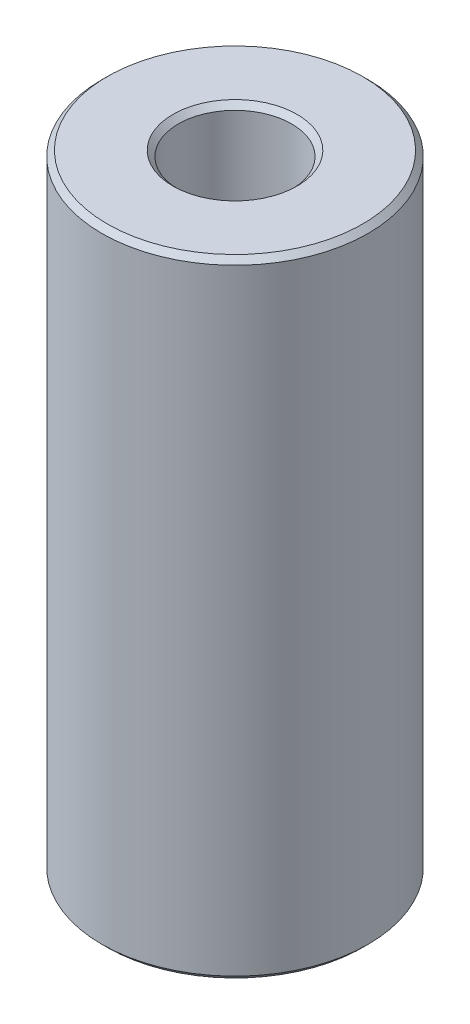
ISO-10303-21;
HEADER;
FILE_DESCRIPTION(('STEP AP214'),'2;1');
FILE_NAME('part.step','',(''),(''),'','','');
FILE_SCHEMA(('AUTOMOTIVE_DESIGN { 1 0 10303 214 1 1 1 1 }'));
ENDSEC;
DATA;
#1=APPLICATION_CONTEXT('core data for automotive mechanical design processes');
#2=APPLICATION_PROTOCOL_DEFINITION('international standard','automotive_design',2000,#1);
#3=PRODUCT_CONTEXT('',#1,'mechanical');
#4=PRODUCT('Part','Part','',(#3));
#5=PRODUCT_RELATED_PRODUCT_CATEGORY('part','',(#4));
#6=PRODUCT_DEFINITION_FORMATION('','',#4);
#7=PRODUCT_DEFINITION_CONTEXT('part definition',#1,'design');
#8=PRODUCT_DEFINITION('design','',#6,#7);
#9=PRODUCT_DEFINITION_SHAPE('','',#8);
#10=(LENGTH_UNIT() NAMED_UNIT(*) SI_UNIT(.MILLI.,.METRE.));
#11=(NAMED_UNIT(*) PLANE_ANGLE_UNIT() SI_UNIT($,.RADIAN.));
#12=(NAMED_UNIT(*) SI_UNIT($,.STERADIAN.) SOLID_ANGLE_UNIT());
#13=UNCERTAINTY_MEASURE_WITH_UNIT(LENGTH_MEASURE(1.E-05),#10,'distance_accuracy_value','');
#14=(GEOMETRIC_REPRESENTATION_CONTEXT(3) GLOBAL_UNCERTAINTY_ASSIGNED_CONTEXT((#13)) GLOBAL_UNIT_ASSIGNED_CONTEXT((#10,
#11,#12)) REPRESENTATION_CONTEXT('',''));
#15=CARTESIAN_POINT('',(0.,0.,0.));
#16=DIRECTION('',(0.,0.,1.));
#17=DIRECTION('',(1.,0.,0.));
#18=AXIS2_PLACEMENT_3D('',#15,#16,#17);
#19=CARTESIAN_POINT('',(0.,223.475805960987,0.));
#20=DIRECTION('',(0.,-1.,0.));
#21=DIRECTION('',(0.,0.,-1.));
#22=AXIS2_PLACEMENT_3D('',#19,#20,#21);
#23=CYLINDRICAL_SURFACE('',#22,47.5);
#24=CARTESIAN_POINT('',(0.,1.95141697992096,0.));
#25=DIRECTION('',(0.,1.,0.));
#26=DIRECTION('',(0.,0.,1.));
#27=AXIS2_PLACEMENT_3D('',#24,#25,#26);
#28=CIRCLE('',#27,47.5);
#29=CARTESIAN_POINT('',(0.,1.95141697992096,47.5));
#30=VERTEX_POINT('',#29);
#31=EDGE_CURVE('E10',#30,#30,#28,.T.);
#32=ORIENTED_EDGE('',*,*,#31,.T.);
#33=EDGE_LOOP('',(#32));
#34=FACE_BOUND('',#33,.T.);
#35=CARTESIAN_POINT('',(0.,221.524388981066,0.));
#36=DIRECTION('',(0.,1.,0.));
#37=DIRECTION('',(0.,0.,1.));
#38=AXIS2_PLACEMENT_3D('',#35,#36,#37);
#39=CIRCLE('',#38,47.5);
#40=CARTESIAN_POINT('',(0.,221.524388981066,47.5));
#41=VERTEX_POINT('',#40);
#42=EDGE_CURVE('E50',#41,#41,#39,.F.);
#43=ORIENTED_EDGE('',*,*,#42,.T.);
#44=EDGE_LOOP('',(#43));
#45=FACE_BOUND('',#44,.T.);
#46=ADVANCED_FACE('F39',(#34,#45),#23,.T.);
#47=CARTESIAN_POINT('',(0.,223.475805960987,0.));
#48=DIRECTION('',(0.,1.,0.));
#49=DIRECTION('',(0.,0.,1.));
#50=AXIS2_PLACEMENT_3D('',#47,#48,#49);
#51=PLANE('',#50);
#52=CARTESIAN_POINT('',(0.,223.475805960987,0.));
#53=DIRECTION('',(0.,1.,0.));
#54=DIRECTION('',(0.,0.,1.));
#55=AXIS2_PLACEMENT_3D('',#52,#53,#54);
#56=CIRCLE('',#55,22.157342980337);
#57=CARTESIAN_POINT('',(0.,223.475805960987,22.157342980337));
#58=VERTEX_POINT('',#57);
#59=EDGE_CURVE('E58',#58,#58,#56,.F.);
#60=ORIENTED_EDGE('',*,*,#59,.T.);
#61=EDGE_LOOP('',(#60));
#62=FACE_BOUND('',#61,.T.);
#63=CARTESIAN_POINT('',(0.,223.475805960987,0.));
#64=DIRECTION('',(0.,1.,0.));
#65=DIRECTION('',(0.,0.,1.));
#66=AXIS2_PLACEMENT_3D('',#63,#64,#65);
#67=CIRCLE('',#66,45.5485830200791);
#68=CARTESIAN_POINT('',(0.,223.475805960987,45.5485830200791));
#69=VERTEX_POINT('',#68);
#70=EDGE_CURVE('E61',#69,#69,#67,.T.);
#71=ORIENTED_EDGE('',*,*,#70,.T.);
#72=EDGE_LOOP('',(#71));
#73=FACE_BOUND('',#72,.T.);
#74=ADVANCED_FACE('F88',(#62,#73),#51,.T.);
#75=CARTESIAN_POINT('',(0.,0.,0.));
#76=DIRECTION('',(0.,1.,0.));
#77=DIRECTION('',(0.,0.,1.));
#78=AXIS2_PLACEMENT_3D('',#75,#76,#77);
#79=PLANE('',#78);
#80=CARTESIAN_POINT('',(0.,0.,0.));
#81=DIRECTION('',(0.,1.,0.));
#82=DIRECTION('',(0.,0.,1.));
#83=AXIS2_PLACEMENT_3D('',#80,#81,#82);
#84=CIRCLE('',#83,22.157342980337);
#85=CARTESIAN_POINT('',(0.,0.,22.157342980337));
#86=VERTEX_POINT('',#85);
#87=EDGE_CURVE('E51',#86,#86,#84,.T.);
#88=ORIENTED_EDGE('',*,*,#87,.T.);
#89=EDGE_LOOP('',(#88));
#90=FACE_BOUND('',#89,.T.);
#91=CARTESIAN_POINT('',(0.,0.,0.));
#92=DIRECTION('',(0.,1.,0.));
#93=DIRECTION('',(0.,0.,1.));
#94=AXIS2_PLACEMENT_3D('',#91,#92,#93);
#95=CIRCLE('',#94,45.5485830200791);
#96=CARTESIAN_POINT('',(0.,0.,45.5485830200791));
#97=VERTEX_POINT('',#96);
#98=EDGE_CURVE('E54',#97,#97,#95,.F.);
#99=ORIENTED_EDGE('',*,*,#98,.T.);
#100=EDGE_LOOP('',(#99));
#101=FACE_BOUND('',#100,.T.);
#102=ADVANCED_FACE('F83',(#90,#101),#79,.F.);
#103=CARTESIAN_POINT('',(0.,223.475805960987,0.));
#104=DIRECTION('',(0.,-1.,0.));
#105=DIRECTION('',(0.,0.,-1.));
#106=AXIS2_PLACEMENT_3D('',#103,#104,#105);
#107=CYLINDRICAL_SURFACE('',#106,20.2059260004161);
#108=CARTESIAN_POINT('',(0.,221.524388981066,0.));
#109=DIRECTION('',(0.,1.,0.));
#110=DIRECTION('',(0.,0.,1.));
#111=AXIS2_PLACEMENT_3D('',#108,#109,#110);
#112=CIRCLE('',#111,20.2059260004161);
#113=CARTESIAN_POINT('',(0.,221.524388981066,20.2059260004161));
#114=VERTEX_POINT('',#113);
#115=EDGE_CURVE('E67',#114,#114,#112,.T.);
#116=ORIENTED_EDGE('',*,*,#115,.T.);
#117=EDGE_LOOP('',(#116));
#118=FACE_BOUND('',#117,.T.);
#119=CARTESIAN_POINT('',(0.,1.95141697992096,0.));
#120=DIRECTION('',(0.,1.,0.));
#121=DIRECTION('',(0.,0.,1.));
#122=AXIS2_PLACEMENT_3D('',#119,#120,#121);
#123=CIRCLE('',#122,20.2059260004161);
#124=CARTESIAN_POINT('',(0.,1.95141697992096,20.2059260004161));
#125=VERTEX_POINT('',#124);
#126=EDGE_CURVE('E69',#125,#125,#123,.F.);
#127=ORIENTED_EDGE('',*,*,#126,.T.);
#128=EDGE_LOOP('',(#127));
#129=FACE_BOUND('',#128,.T.);
#130=ADVANCED_FACE('F71',(#118,#129),#107,.F.);
#131=CARTESIAN_POINT('',(0.,221.524388981066,0.));
#132=DIRECTION('',(0.,1.,0.));
#133=DIRECTION('',(0.,0.,1.));
#134=AXIS2_PLACEMENT_3D('',#131,#132,#133);
#135=CONICAL_SURFACE('',#134,20.2059260004161,0.78539816339745);
#136=ORIENTED_EDGE('',*,*,#59,.F.);
#137=EDGE_LOOP('',(#136));
#138=FACE_BOUND('',#137,.T.);
#139=ORIENTED_EDGE('',*,*,#115,.F.);
#140=EDGE_LOOP('',(#139));
#141=FACE_BOUND('',#140,.T.);
#142=ADVANCED_FACE('F77',(#138,#141),#135,.F.);
#143=CARTESIAN_POINT('',(0.,0.,0.));
#144=DIRECTION('',(0.,-1.,0.));
#145=DIRECTION('',(0.,0.,-1.));
#146=AXIS2_PLACEMENT_3D('',#143,#144,#145);
#147=CONICAL_SURFACE('',#146,22.157342980337,0.78539816339745);
#148=ORIENTED_EDGE('',*,*,#126,.F.);
#149=EDGE_LOOP('',(#148));
#150=FACE_BOUND('',#149,.T.);
#151=ORIENTED_EDGE('',*,*,#87,.F.);
#152=EDGE_LOOP('',(#151));
#153=FACE_BOUND('',#152,.T.);
#154=ADVANCED_FACE('F73',(#150,#153),#147,.F.);
#155=CARTESIAN_POINT('',(0.,1.95141697992096,0.));
#156=DIRECTION('',(0.,1.,0.));
#157=DIRECTION('',(0.,0.,1.));
#158=AXIS2_PLACEMENT_3D('',#155,#156,#157);
#159=CONICAL_SURFACE('',#158,47.5,0.785398163397447);
#160=ORIENTED_EDGE('',*,*,#98,.F.);
#161=EDGE_LOOP('',(#160));
#162=FACE_BOUND('',#161,.T.);
#163=ORIENTED_EDGE('',*,*,#31,.F.);
#164=EDGE_LOOP('',(#163));
#165=FACE_BOUND('',#164,.T.);
#166=ADVANCED_FACE('F76',(#162,#165),#159,.T.);
#167=CARTESIAN_POINT('',(0.,223.475805960987,0.));
#168=DIRECTION('',(0.,-1.,0.));
#169=DIRECTION('',(0.,0.,-1.));
#170=AXIS2_PLACEMENT_3D('',#167,#168,#169);
#171=CONICAL_SURFACE('',#170,45.5485830200791,0.785398163397439);
#172=ORIENTED_EDGE('',*,*,#42,.F.);
#173=EDGE_LOOP('',(#172));
#174=FACE_BOUND('',#173,.T.);
#175=ORIENTED_EDGE('',*,*,#70,.F.);
#176=EDGE_LOOP('',(#175));
#177=FACE_BOUND('',#176,.T.);
#178=ADVANCED_FACE('F45',(#174,#177),#171,.T.);
#179=CLOSED_SHELL('',(#46,#74,#102,#130,#142,#154,#166,#178));
#180=MANIFOLD_SOLID_BREP('B2',#179);
#181=ADVANCED_BREP_SHAPE_REPRESENTATION('',(#18,#180),#14);
#182=SHAPE_DEFINITION_REPRESENTATION(#9,#181);
ENDSEC;
END-ISO-10303-21;
